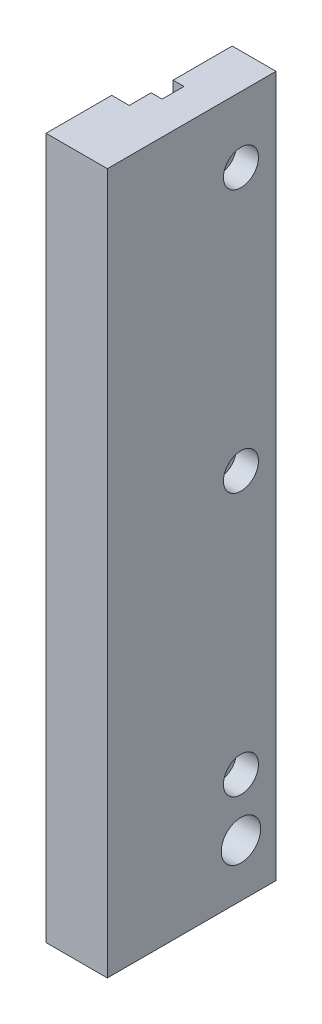
ISO-10303-21;
HEADER;
FILE_DESCRIPTION(('STEP AP214'),'2;1');
FILE_NAME('part.step','',(''),(''),'','','');
FILE_SCHEMA(('AUTOMOTIVE_DESIGN { 1 0 10303 214 1 1 1 1 }'));
ENDSEC;
DATA;
#1=APPLICATION_CONTEXT('core data for automotive mechanical design processes');
#2=APPLICATION_PROTOCOL_DEFINITION('international standard','automotive_design',2000,#1);
#3=PRODUCT_CONTEXT('',#1,'mechanical');
#4=PRODUCT('Part','Part','',(#3));
#5=PRODUCT_RELATED_PRODUCT_CATEGORY('part','',(#4));
#6=PRODUCT_DEFINITION_FORMATION('','',#4);
#7=PRODUCT_DEFINITION_CONTEXT('part definition',#1,'design');
#8=PRODUCT_DEFINITION('design','',#6,#7);
#9=PRODUCT_DEFINITION_SHAPE('','',#8);
#10=(LENGTH_UNIT() NAMED_UNIT(*) SI_UNIT(.MILLI.,.METRE.));
#11=(NAMED_UNIT(*) PLANE_ANGLE_UNIT() SI_UNIT($,.RADIAN.));
#12=(NAMED_UNIT(*) SI_UNIT($,.STERADIAN.) SOLID_ANGLE_UNIT());
#13=UNCERTAINTY_MEASURE_WITH_UNIT(LENGTH_MEASURE(1.E-05),#10,'distance_accuracy_value','');
#14=(GEOMETRIC_REPRESENTATION_CONTEXT(3) GLOBAL_UNCERTAINTY_ASSIGNED_CONTEXT((#13)) GLOBAL_UNIT_ASSIGNED_CONTEXT((#10,
#11,#12)) REPRESENTATION_CONTEXT('',''));
#15=CARTESIAN_POINT('',(0.,0.,0.));
#16=DIRECTION('',(0.,0.,1.));
#17=DIRECTION('',(1.,0.,0.));
#18=AXIS2_PLACEMENT_3D('',#15,#16,#17);
#19=CARTESIAN_POINT('',(10.,160.,0.));
#20=DIRECTION('',(0.,0.,-1.));
#21=DIRECTION('',(-1.,0.,0.));
#22=AXIS2_PLACEMENT_3D('',#19,#20,#21);
#23=PLANE('',#22);
#24=DIRECTION('',(1.,0.,0.));
#25=VECTOR('',#24,1.);
#26=CARTESIAN_POINT('',(10.,0.,0.));
#27=LINE('',#26,#25);
#28=CARTESIAN_POINT('',(-4.,0.,0.));
#29=VERTEX_POINT('',#28);
#30=CARTESIAN_POINT('',(10.,0.,0.));
#31=VERTEX_POINT('',#30);
#32=EDGE_CURVE('E99',#29,#31,#27,.T.);
#33=ORIENTED_EDGE('',*,*,#32,.T.);
#34=DIRECTION('',(0.,-1.,0.));
#35=VECTOR('',#34,1.);
#36=CARTESIAN_POINT('',(10.,160.,0.));
#37=LINE('',#36,#35);
#38=CARTESIAN_POINT('',(10.,160.,0.));
#39=VERTEX_POINT('',#38);
#40=EDGE_CURVE('E11',#39,#31,#37,.T.);
#41=ORIENTED_EDGE('',*,*,#40,.F.);
#42=DIRECTION('',(1.,0.,0.));
#43=VECTOR('',#42,1.);
#44=CARTESIAN_POINT('',(-4.,160.,0.));
#45=LINE('',#44,#43);
#46=CARTESIAN_POINT('',(-4.,160.,0.));
#47=VERTEX_POINT('',#46);
#48=EDGE_CURVE('E105',#47,#39,#45,.T.);
#49=ORIENTED_EDGE('',*,*,#48,.F.);
#50=DIRECTION('',(0.,-1.,0.));
#51=VECTOR('',#50,1.);
#52=CARTESIAN_POINT('',(-4.,160.,0.));
#53=LINE('',#52,#51);
#54=EDGE_CURVE('E145',#47,#29,#53,.T.);
#55=ORIENTED_EDGE('',*,*,#54,.T.);
#56=EDGE_LOOP('',(#33,#41,#49,#55));
#57=FACE_BOUND('',#56,.T.);
#58=ADVANCED_FACE('F39',(#57),#23,.F.);
#59=CARTESIAN_POINT('',(10.,160.,-38.5));
#60=DIRECTION('',(-1.,0.,0.));
#61=DIRECTION('',(0.,0.,1.));
#62=AXIS2_PLACEMENT_3D('',#59,#60,#61);
#63=PLANE('',#62);
#64=CARTESIAN_POINT('',(10.,145.,-30.5));
#65=DIRECTION('',(1.,0.,0.));
#66=DIRECTION('',(0.,0.,-1.));
#67=AXIS2_PLACEMENT_3D('',#64,#65,#66);
#68=CIRCLE('',#67,4.00000000000001);
#69=CARTESIAN_POINT('',(10.,145.,-34.5));
#70=VERTEX_POINT('',#69);
#71=EDGE_CURVE('E270',#70,#70,#68,.T.);
#72=ORIENTED_EDGE('',*,*,#71,.F.);
#73=EDGE_LOOP('',(#72));
#74=FACE_BOUND('',#73,.T.);
#75=CARTESIAN_POINT('',(10.,85.,-30.5));
#76=DIRECTION('',(1.,0.,0.));
#77=DIRECTION('',(0.,0.,-1.));
#78=AXIS2_PLACEMENT_3D('',#75,#76,#77);
#79=CIRCLE('',#78,4.00000000000001);
#80=CARTESIAN_POINT('',(10.,85.,-34.5));
#81=VERTEX_POINT('',#80);
#82=EDGE_CURVE('E274',#81,#81,#79,.T.);
#83=ORIENTED_EDGE('',*,*,#82,.F.);
#84=EDGE_LOOP('',(#83));
#85=FACE_BOUND('',#84,.T.);
#86=CARTESIAN_POINT('',(10.,25.,-30.5));
#87=DIRECTION('',(1.,0.,0.));
#88=DIRECTION('',(0.,0.,-1.));
#89=AXIS2_PLACEMENT_3D('',#86,#87,#88);
#90=CIRCLE('',#89,4.00000000000001);
#91=CARTESIAN_POINT('',(10.,25.,-34.5));
#92=VERTEX_POINT('',#91);
#93=EDGE_CURVE('E205',#92,#92,#90,.T.);
#94=ORIENTED_EDGE('',*,*,#93,.F.);
#95=EDGE_LOOP('',(#94));
#96=FACE_BOUND('',#95,.T.);
#97=CARTESIAN_POINT('',(10.,12.,-30.5));
#98=DIRECTION('',(1.,0.,0.));
#99=DIRECTION('',(0.,0.,-1.));
#100=AXIS2_PLACEMENT_3D('',#97,#98,#99);
#101=CIRCLE('',#100,4.5);
#102=CARTESIAN_POINT('',(10.,12.,-35.));
#103=VERTEX_POINT('',#102);
#104=EDGE_CURVE('E196',#103,#103,#101,.T.);
#105=ORIENTED_EDGE('',*,*,#104,.F.);
#106=EDGE_LOOP('',(#105));
#107=FACE_BOUND('',#106,.T.);
#108=DIRECTION('',(0.,0.,-1.));
#109=VECTOR('',#108,1.);
#110=CARTESIAN_POINT('',(10.,0.,-38.5));
#111=LINE('',#110,#109);
#112=CARTESIAN_POINT('',(10.,0.,-38.5));
#113=VERTEX_POINT('',#112);
#114=EDGE_CURVE('E150',#31,#113,#111,.T.);
#115=ORIENTED_EDGE('',*,*,#114,.T.);
#116=DIRECTION('',(0.,-1.,0.));
#117=VECTOR('',#116,1.);
#118=CARTESIAN_POINT('',(10.,160.,-38.5));
#119=LINE('',#118,#117);
#120=CARTESIAN_POINT('',(10.,160.,-38.5));
#121=VERTEX_POINT('',#120);
#122=EDGE_CURVE('E48',#121,#113,#119,.T.);
#123=ORIENTED_EDGE('',*,*,#122,.F.);
#124=DIRECTION('',(0.,0.,-1.));
#125=VECTOR('',#124,1.);
#126=CARTESIAN_POINT('',(10.,160.,-38.5));
#127=LINE('',#126,#125);
#128=EDGE_CURVE('E210',#39,#121,#127,.T.);
#129=ORIENTED_EDGE('',*,*,#128,.F.);
#130=ORIENTED_EDGE('',*,*,#40,.T.);
#131=EDGE_LOOP('',(#115,#123,#129,#130));
#132=FACE_BOUND('',#131,.T.);
#133=ADVANCED_FACE('F236',(#74,#85,#96,#107,#132),#63,.F.);
#134=CARTESIAN_POINT('',(0.,160.,-38.5));
#135=DIRECTION('',(0.,0.,1.));
#136=DIRECTION('',(1.,0.,0.));
#137=AXIS2_PLACEMENT_3D('',#134,#135,#136);
#138=PLANE('',#137);
#139=DIRECTION('',(-1.,0.,0.));
#140=VECTOR('',#139,1.);
#141=CARTESIAN_POINT('',(0.,0.,-38.5));
#142=LINE('',#141,#140);
#143=CARTESIAN_POINT('',(0.,0.,-38.5));
#144=VERTEX_POINT('',#143);
#145=EDGE_CURVE('E153',#113,#144,#142,.T.);
#146=ORIENTED_EDGE('',*,*,#145,.T.);
#147=DIRECTION('',(0.,-1.,0.));
#148=VECTOR('',#147,1.);
#149=CARTESIAN_POINT('',(0.,160.,-38.5));
#150=LINE('',#149,#148);
#151=CARTESIAN_POINT('',(0.,160.,-38.5));
#152=VERTEX_POINT('',#151);
#153=EDGE_CURVE('E180',#152,#144,#150,.T.);
#154=ORIENTED_EDGE('',*,*,#153,.F.);
#155=DIRECTION('',(-1.,0.,0.));
#156=VECTOR('',#155,1.);
#157=CARTESIAN_POINT('',(0.,160.,-38.5));
#158=LINE('',#157,#156);
#159=EDGE_CURVE('E212',#121,#152,#158,.T.);
#160=ORIENTED_EDGE('',*,*,#159,.F.);
#161=ORIENTED_EDGE('',*,*,#122,.T.);
#162=EDGE_LOOP('',(#146,#154,#160,#161));
#163=FACE_BOUND('',#162,.T.);
#164=ADVANCED_FACE('F242',(#163),#138,.F.);
#165=CARTESIAN_POINT('',(0.,160.,-25.));
#166=DIRECTION('',(1.,0.,0.));
#167=DIRECTION('',(0.,0.,-1.));
#168=AXIS2_PLACEMENT_3D('',#165,#166,#167);
#169=PLANE('',#168);
#170=CARTESIAN_POINT('',(0.,145.,-30.5));
#171=DIRECTION('',(1.,0.,0.));
#172=DIRECTION('',(0.,0.,-1.));
#173=AXIS2_PLACEMENT_3D('',#170,#171,#172);
#174=CIRCLE('',#173,2.5);
#175=CARTESIAN_POINT('',(0.,145.,-33.));
#176=VERTEX_POINT('',#175);
#177=EDGE_CURVE('E42',#176,#176,#174,.T.);
#178=ORIENTED_EDGE('',*,*,#177,.T.);
#179=EDGE_LOOP('',(#178));
#180=FACE_BOUND('',#179,.T.);
#181=CARTESIAN_POINT('',(0.,85.,-30.5));
#182=DIRECTION('',(1.,0.,0.));
#183=DIRECTION('',(0.,0.,-1.));
#184=AXIS2_PLACEMENT_3D('',#181,#182,#183);
#185=CIRCLE('',#184,2.5);
#186=CARTESIAN_POINT('',(0.,85.,-33.));
#187=VERTEX_POINT('',#186);
#188=EDGE_CURVE('E191',#187,#187,#185,.T.);
#189=ORIENTED_EDGE('',*,*,#188,.T.);
#190=EDGE_LOOP('',(#189));
#191=FACE_BOUND('',#190,.T.);
#192=CARTESIAN_POINT('',(0.,25.,-30.5));
#193=DIRECTION('',(1.,0.,0.));
#194=DIRECTION('',(0.,0.,-1.));
#195=AXIS2_PLACEMENT_3D('',#192,#193,#194);
#196=CIRCLE('',#195,2.5);
#197=CARTESIAN_POINT('',(0.,25.,-33.));
#198=VERTEX_POINT('',#197);
#199=EDGE_CURVE('E188',#198,#198,#196,.T.);
#200=ORIENTED_EDGE('',*,*,#199,.T.);
#201=EDGE_LOOP('',(#200));
#202=FACE_BOUND('',#201,.T.);
#203=CARTESIAN_POINT('',(0.,12.,-30.5));
#204=DIRECTION('',(1.,0.,0.));
#205=DIRECTION('',(0.,0.,-1.));
#206=AXIS2_PLACEMENT_3D('',#203,#204,#205);
#207=CIRCLE('',#206,4.5);
#208=CARTESIAN_POINT('',(0.,12.,-35.));
#209=VERTEX_POINT('',#208);
#210=EDGE_CURVE('E185',#209,#209,#207,.T.);
#211=ORIENTED_EDGE('',*,*,#210,.T.);
#212=EDGE_LOOP('',(#211));
#213=FACE_BOUND('',#212,.T.);
#214=DIRECTION('',(0.,0.,1.));
#215=VECTOR('',#214,1.);
#216=CARTESIAN_POINT('',(0.,0.,-25.));
#217=LINE('',#216,#215);
#218=CARTESIAN_POINT('',(0.,0.,-25.));
#219=VERTEX_POINT('',#218);
#220=EDGE_CURVE('E155',#144,#219,#217,.T.);
#221=ORIENTED_EDGE('',*,*,#220,.T.);
#222=DIRECTION('',(0.,-1.,0.));
#223=VECTOR('',#222,1.);
#224=CARTESIAN_POINT('',(0.,160.,-25.));
#225=LINE('',#224,#223);
#226=CARTESIAN_POINT('',(0.,160.,-25.));
#227=VERTEX_POINT('',#226);
#228=EDGE_CURVE('E177',#227,#219,#225,.T.);
#229=ORIENTED_EDGE('',*,*,#228,.F.);
#230=DIRECTION('',(0.,0.,1.));
#231=VECTOR('',#230,1.);
#232=CARTESIAN_POINT('',(0.,160.,-25.));
#233=LINE('',#232,#231);
#234=EDGE_CURVE('E214',#152,#227,#233,.T.);
#235=ORIENTED_EDGE('',*,*,#234,.F.);
#236=ORIENTED_EDGE('',*,*,#153,.T.);
#237=EDGE_LOOP('',(#221,#229,#235,#236));
#238=FACE_BOUND('',#237,.T.);
#239=ADVANCED_FACE('F246',(#180,#191,#202,#213,#238),#169,.F.);
#240=CARTESIAN_POINT('',(2.5,160.,-25.));
#241=DIRECTION('',(0.,0.,-1.));
#242=DIRECTION('',(-1.,0.,0.));
#243=AXIS2_PLACEMENT_3D('',#240,#241,#242);
#244=PLANE('',#243);
#245=DIRECTION('',(1.,0.,0.));
#246=VECTOR('',#245,1.);
#247=CARTESIAN_POINT('',(2.5,0.,-25.));
#248=LINE('',#247,#246);
#249=CARTESIAN_POINT('',(2.5,0.,-25.));
#250=VERTEX_POINT('',#249);
#251=EDGE_CURVE('E157',#219,#250,#248,.T.);
#252=ORIENTED_EDGE('',*,*,#251,.T.);
#253=DIRECTION('',(0.,-1.,0.));
#254=VECTOR('',#253,1.);
#255=CARTESIAN_POINT('',(2.5,160.,-25.));
#256=LINE('',#255,#254);
#257=CARTESIAN_POINT('',(2.5,160.,-25.));
#258=VERTEX_POINT('',#257);
#259=EDGE_CURVE('E174',#258,#250,#256,.T.);
#260=ORIENTED_EDGE('',*,*,#259,.F.);
#261=DIRECTION('',(1.,0.,0.));
#262=VECTOR('',#261,1.);
#263=CARTESIAN_POINT('',(2.5,160.,-25.));
#264=LINE('',#263,#262);
#265=EDGE_CURVE('E216',#227,#258,#264,.T.);
#266=ORIENTED_EDGE('',*,*,#265,.F.);
#267=ORIENTED_EDGE('',*,*,#228,.T.);
#268=EDGE_LOOP('',(#252,#260,#266,#267));
#269=FACE_BOUND('',#268,.T.);
#270=ADVANCED_FACE('F249',(#269),#244,.F.);
#271=CARTESIAN_POINT('',(2.5,160.,-20.));
#272=DIRECTION('',(1.,0.,0.));
#273=DIRECTION('',(0.,0.,-1.));
#274=AXIS2_PLACEMENT_3D('',#271,#272,#273);
#275=PLANE('',#274);
#276=DIRECTION('',(0.,0.,1.));
#277=VECTOR('',#276,1.);
#278=CARTESIAN_POINT('',(2.5,0.,-20.));
#279=LINE('',#278,#277);
#280=CARTESIAN_POINT('',(2.5,0.,-20.));
#281=VERTEX_POINT('',#280);
#282=EDGE_CURVE('E159',#250,#281,#279,.T.);
#283=ORIENTED_EDGE('',*,*,#282,.T.);
#284=DIRECTION('',(0.,-1.,0.));
#285=VECTOR('',#284,1.);
#286=CARTESIAN_POINT('',(2.5,160.,-20.));
#287=LINE('',#286,#285);
#288=CARTESIAN_POINT('',(2.5,160.,-20.));
#289=VERTEX_POINT('',#288);
#290=EDGE_CURVE('E171',#289,#281,#287,.T.);
#291=ORIENTED_EDGE('',*,*,#290,.F.);
#292=DIRECTION('',(0.,0.,1.));
#293=VECTOR('',#292,1.);
#294=CARTESIAN_POINT('',(2.5,160.,-20.));
#295=LINE('',#294,#293);
#296=EDGE_CURVE('E218',#258,#289,#295,.T.);
#297=ORIENTED_EDGE('',*,*,#296,.F.);
#298=ORIENTED_EDGE('',*,*,#259,.T.);
#299=EDGE_LOOP('',(#283,#291,#297,#298));
#300=FACE_BOUND('',#299,.T.);
#301=ADVANCED_FACE('F224',(#300),#275,.F.);
#302=CARTESIAN_POINT('',(0.,160.,-20.));
#303=DIRECTION('',(0.,0.,1.));
#304=DIRECTION('',(1.,0.,0.));
#305=AXIS2_PLACEMENT_3D('',#302,#303,#304);
#306=PLANE('',#305);
#307=DIRECTION('',(-1.,0.,0.));
#308=VECTOR('',#307,1.);
#309=CARTESIAN_POINT('',(0.,0.,-20.));
#310=LINE('',#309,#308);
#311=CARTESIAN_POINT('',(0.,0.,-20.));
#312=VERTEX_POINT('',#311);
#313=EDGE_CURVE('E161',#281,#312,#310,.T.);
#314=ORIENTED_EDGE('',*,*,#313,.T.);
#315=DIRECTION('',(0.,-1.,0.));
#316=VECTOR('',#315,1.);
#317=CARTESIAN_POINT('',(0.,160.,-20.));
#318=LINE('',#317,#316);
#319=CARTESIAN_POINT('',(0.,160.,-20.));
#320=VERTEX_POINT('',#319);
#321=EDGE_CURVE('E140',#320,#312,#318,.T.);
#322=ORIENTED_EDGE('',*,*,#321,.F.);
#323=DIRECTION('',(-1.,0.,0.));
#324=VECTOR('',#323,1.);
#325=CARTESIAN_POINT('',(0.,160.,-20.));
#326=LINE('',#325,#324);
#327=EDGE_CURVE('E131',#289,#320,#326,.T.);
#328=ORIENTED_EDGE('',*,*,#327,.F.);
#329=ORIENTED_EDGE('',*,*,#290,.T.);
#330=EDGE_LOOP('',(#314,#322,#328,#329));
#331=FACE_BOUND('',#330,.T.);
#332=ADVANCED_FACE('F228',(#331),#306,.F.);
#333=CARTESIAN_POINT('',(0.,160.,-20.));
#334=DIRECTION('',(1.,0.,0.));
#335=DIRECTION('',(0.,0.,-1.));
#336=AXIS2_PLACEMENT_3D('',#333,#334,#335);
#337=PLANE('',#336);
#338=DIRECTION('',(0.,0.,1.));
#339=VECTOR('',#338,1.);
#340=CARTESIAN_POINT('',(0.,0.,-20.));
#341=LINE('',#340,#339);
#342=CARTESIAN_POINT('',(0.,0.,-15.));
#343=VERTEX_POINT('',#342);
#344=EDGE_CURVE('E139',#312,#343,#341,.T.);
#345=ORIENTED_EDGE('',*,*,#344,.T.);
#346=DIRECTION('',(0.,-1.,0.));
#347=VECTOR('',#346,1.);
#348=CARTESIAN_POINT('',(0.,160.,-15.));
#349=LINE('',#348,#347);
#350=CARTESIAN_POINT('',(0.,160.,-15.));
#351=VERTEX_POINT('',#350);
#352=EDGE_CURVE('E136',#351,#343,#349,.T.);
#353=ORIENTED_EDGE('',*,*,#352,.F.);
#354=DIRECTION('',(0.,0.,1.));
#355=VECTOR('',#354,1.);
#356=CARTESIAN_POINT('',(0.,160.,-20.));
#357=LINE('',#356,#355);
#358=EDGE_CURVE('E125',#320,#351,#357,.T.);
#359=ORIENTED_EDGE('',*,*,#358,.F.);
#360=ORIENTED_EDGE('',*,*,#321,.T.);
#361=EDGE_LOOP('',(#345,#353,#359,#360));
#362=FACE_BOUND('',#361,.T.);
#363=ADVANCED_FACE('F137',(#362),#337,.F.);
#364=CARTESIAN_POINT('',(0.,160.,-15.));
#365=DIRECTION('',(0.,0.,1.));
#366=DIRECTION('',(1.,0.,0.));
#367=AXIS2_PLACEMENT_3D('',#364,#365,#366);
#368=PLANE('',#367);
#369=DIRECTION('',(-1.,0.,0.));
#370=VECTOR('',#369,1.);
#371=CARTESIAN_POINT('',(0.,0.,-15.));
#372=LINE('',#371,#370);
#373=CARTESIAN_POINT('',(-4.,0.,-15.));
#374=VERTEX_POINT('',#373);
#375=EDGE_CURVE('E92',#343,#374,#372,.T.);
#376=ORIENTED_EDGE('',*,*,#375,.T.);
#377=DIRECTION('',(0.,-1.,0.));
#378=VECTOR('',#377,1.);
#379=CARTESIAN_POINT('',(-4.,160.,-15.));
#380=LINE('',#379,#378);
#381=CARTESIAN_POINT('',(-4.,160.,-15.));
#382=VERTEX_POINT('',#381);
#383=EDGE_CURVE('E141',#382,#374,#380,.T.);
#384=ORIENTED_EDGE('',*,*,#383,.F.);
#385=DIRECTION('',(-1.,0.,0.));
#386=VECTOR('',#385,1.);
#387=CARTESIAN_POINT('',(0.,160.,-15.));
#388=LINE('',#387,#386);
#389=EDGE_CURVE('E129',#351,#382,#388,.T.);
#390=ORIENTED_EDGE('',*,*,#389,.F.);
#391=ORIENTED_EDGE('',*,*,#352,.T.);
#392=EDGE_LOOP('',(#376,#384,#390,#391));
#393=FACE_BOUND('',#392,.T.);
#394=ADVANCED_FACE('F143',(#393),#368,.F.);
#395=CARTESIAN_POINT('',(-4.,160.,-15.));
#396=DIRECTION('',(1.,0.,0.));
#397=DIRECTION('',(0.,0.,-1.));
#398=AXIS2_PLACEMENT_3D('',#395,#396,#397);
#399=PLANE('',#398);
#400=DIRECTION('',(0.,0.,1.));
#401=VECTOR('',#400,1.);
#402=CARTESIAN_POINT('',(-4.,0.,-15.));
#403=LINE('',#402,#401);
#404=EDGE_CURVE('E165',#374,#29,#403,.T.);
#405=ORIENTED_EDGE('',*,*,#404,.T.);
#406=ORIENTED_EDGE('',*,*,#54,.F.);
#407=DIRECTION('',(0.,0.,1.));
#408=VECTOR('',#407,1.);
#409=CARTESIAN_POINT('',(-4.,160.,-15.));
#410=LINE('',#409,#408);
#411=EDGE_CURVE('E57',#382,#47,#410,.T.);
#412=ORIENTED_EDGE('',*,*,#411,.F.);
#413=ORIENTED_EDGE('',*,*,#383,.T.);
#414=EDGE_LOOP('',(#405,#406,#412,#413));
#415=FACE_BOUND('',#414,.T.);
#416=ADVANCED_FACE('F231',(#415),#399,.F.);
#417=CARTESIAN_POINT('',(0.,160.,0.));
#418=DIRECTION('',(0.,-1.,0.));
#419=DIRECTION('',(0.,0.,-1.));
#420=AXIS2_PLACEMENT_3D('',#417,#418,#419);
#421=PLANE('',#420);
#422=ORIENTED_EDGE('',*,*,#48,.T.);
#423=ORIENTED_EDGE('',*,*,#128,.T.);
#424=ORIENTED_EDGE('',*,*,#159,.T.);
#425=ORIENTED_EDGE('',*,*,#234,.T.);
#426=ORIENTED_EDGE('',*,*,#265,.T.);
#427=ORIENTED_EDGE('',*,*,#296,.T.);
#428=ORIENTED_EDGE('',*,*,#327,.T.);
#429=ORIENTED_EDGE('',*,*,#358,.T.);
#430=ORIENTED_EDGE('',*,*,#389,.T.);
#431=ORIENTED_EDGE('',*,*,#411,.T.);
#432=EDGE_LOOP('',(#422,#423,#424,#425,#426,#427,#428,#429,#430,#431));
#433=FACE_BOUND('',#432,.T.);
#434=ADVANCED_FACE('F127',(#433),#421,.F.);
#435=CARTESIAN_POINT('',(0.,0.,0.));
#436=DIRECTION('',(0.,-1.,0.));
#437=DIRECTION('',(0.,0.,-1.));
#438=AXIS2_PLACEMENT_3D('',#435,#436,#437);
#439=PLANE('',#438);
#440=ORIENTED_EDGE('',*,*,#32,.F.);
#441=ORIENTED_EDGE('',*,*,#404,.F.);
#442=ORIENTED_EDGE('',*,*,#375,.F.);
#443=ORIENTED_EDGE('',*,*,#344,.F.);
#444=ORIENTED_EDGE('',*,*,#313,.F.);
#445=ORIENTED_EDGE('',*,*,#282,.F.);
#446=ORIENTED_EDGE('',*,*,#251,.F.);
#447=ORIENTED_EDGE('',*,*,#220,.F.);
#448=ORIENTED_EDGE('',*,*,#145,.F.);
#449=ORIENTED_EDGE('',*,*,#114,.F.);
#450=EDGE_LOOP('',(#440,#441,#442,#443,#444,#445,#446,#447,#448,#449));
#451=FACE_BOUND('',#450,.T.);
#452=ADVANCED_FACE('F229',(#451),#439,.T.);
#453=CARTESIAN_POINT('',(5.,12.,-30.5));
#454=DIRECTION('',(1.,0.,0.));
#455=DIRECTION('',(0.,0.,-1.));
#456=AXIS2_PLACEMENT_3D('',#453,#454,#455);
#457=CYLINDRICAL_SURFACE('',#456,4.5);
#458=ORIENTED_EDGE('',*,*,#104,.T.);
#459=EDGE_LOOP('',(#458));
#460=FACE_BOUND('',#459,.T.);
#461=ORIENTED_EDGE('',*,*,#210,.F.);
#462=EDGE_LOOP('',(#461));
#463=FACE_BOUND('',#462,.T.);
#464=ADVANCED_FACE('F326',(#460,#463),#457,.F.);
#465=CARTESIAN_POINT('',(5.,25.,-30.5));
#466=DIRECTION('',(1.,0.,0.));
#467=DIRECTION('',(0.,0.,-1.));
#468=AXIS2_PLACEMENT_3D('',#465,#466,#467);
#469=CYLINDRICAL_SURFACE('',#468,4.00000000000001);
#470=CARTESIAN_POINT('',(5.,25.,-30.5));
#471=DIRECTION('',(1.,0.,0.));
#472=DIRECTION('',(0.,0.,-1.));
#473=AXIS2_PLACEMENT_3D('',#470,#471,#472);
#474=CIRCLE('',#473,4.00000000000001);
#475=CARTESIAN_POINT('',(5.,25.,-34.5));
#476=VERTEX_POINT('',#475);
#477=EDGE_CURVE('E200',#476,#476,#474,.T.);
#478=ORIENTED_EDGE('',*,*,#477,.F.);
#479=EDGE_LOOP('',(#478));
#480=FACE_BOUND('',#479,.T.);
#481=ORIENTED_EDGE('',*,*,#93,.T.);
#482=EDGE_LOOP('',(#481));
#483=FACE_BOUND('',#482,.T.);
#484=ADVANCED_FACE('F323',(#480,#483),#469,.F.);
#485=CARTESIAN_POINT('',(5.,25.,-30.5));
#486=DIRECTION('',(1.,0.,0.));
#487=DIRECTION('',(0.,0.,-1.));
#488=AXIS2_PLACEMENT_3D('',#485,#486,#487);
#489=PLANE('',#488);
#490=CARTESIAN_POINT('',(5.,25.,-30.5));
#491=DIRECTION('',(1.,0.,0.));
#492=DIRECTION('',(0.,0.,-1.));
#493=AXIS2_PLACEMENT_3D('',#490,#491,#492);
#494=CIRCLE('',#493,2.5);
#495=CARTESIAN_POINT('',(5.,25.,-33.));
#496=VERTEX_POINT('',#495);
#497=EDGE_CURVE('E287',#496,#496,#494,.T.);
#498=ORIENTED_EDGE('',*,*,#497,.F.);
#499=EDGE_LOOP('',(#498));
#500=FACE_BOUND('',#499,.T.);
#501=ORIENTED_EDGE('',*,*,#477,.T.);
#502=EDGE_LOOP('',(#501));
#503=FACE_BOUND('',#502,.T.);
#504=ADVANCED_FACE('F320',(#500,#503),#489,.T.);
#505=CARTESIAN_POINT('',(5.,85.,-30.5));
#506=DIRECTION('',(1.,0.,0.));
#507=DIRECTION('',(0.,0.,-1.));
#508=AXIS2_PLACEMENT_3D('',#505,#506,#507);
#509=CYLINDRICAL_SURFACE('',#508,4.00000000000001);
#510=CARTESIAN_POINT('',(5.,85.,-30.5));
#511=DIRECTION('',(1.,0.,0.));
#512=DIRECTION('',(0.,0.,-1.));
#513=AXIS2_PLACEMENT_3D('',#510,#511,#512);
#514=CIRCLE('',#513,4.00000000000001);
#515=CARTESIAN_POINT('',(5.,85.,-34.5));
#516=VERTEX_POINT('',#515);
#517=EDGE_CURVE('E279',#516,#516,#514,.T.);
#518=ORIENTED_EDGE('',*,*,#517,.F.);
#519=EDGE_LOOP('',(#518));
#520=FACE_BOUND('',#519,.T.);
#521=ORIENTED_EDGE('',*,*,#82,.T.);
#522=EDGE_LOOP('',(#521));
#523=FACE_BOUND('',#522,.T.);
#524=ADVANCED_FACE('F314',(#520,#523),#509,.F.);
#525=CARTESIAN_POINT('',(5.,85.,-30.5));
#526=DIRECTION('',(1.,0.,0.));
#527=DIRECTION('',(0.,0.,-1.));
#528=AXIS2_PLACEMENT_3D('',#525,#526,#527);
#529=PLANE('',#528);
#530=CARTESIAN_POINT('',(5.,85.,-30.5));
#531=DIRECTION('',(1.,0.,0.));
#532=DIRECTION('',(0.,0.,-1.));
#533=AXIS2_PLACEMENT_3D('',#530,#531,#532);
#534=CIRCLE('',#533,2.5);
#535=CARTESIAN_POINT('',(5.,85.,-33.));
#536=VERTEX_POINT('',#535);
#537=EDGE_CURVE('E290',#536,#536,#534,.T.);
#538=ORIENTED_EDGE('',*,*,#537,.F.);
#539=EDGE_LOOP('',(#538));
#540=FACE_BOUND('',#539,.T.);
#541=ORIENTED_EDGE('',*,*,#517,.T.);
#542=EDGE_LOOP('',(#541));
#543=FACE_BOUND('',#542,.T.);
#544=ADVANCED_FACE('F309',(#540,#543),#529,.T.);
#545=CARTESIAN_POINT('',(5.,145.,-30.5));
#546=DIRECTION('',(1.,0.,0.));
#547=DIRECTION('',(0.,0.,-1.));
#548=AXIS2_PLACEMENT_3D('',#545,#546,#547);
#549=CYLINDRICAL_SURFACE('',#548,4.00000000000001);
#550=CARTESIAN_POINT('',(5.,145.,-30.5));
#551=DIRECTION('',(1.,0.,0.));
#552=DIRECTION('',(0.,0.,-1.));
#553=AXIS2_PLACEMENT_3D('',#550,#551,#552);
#554=CIRCLE('',#553,4.00000000000001);
#555=CARTESIAN_POINT('',(5.,145.,-34.5));
#556=VERTEX_POINT('',#555);
#557=EDGE_CURVE('E151',#556,#556,#554,.T.);
#558=ORIENTED_EDGE('',*,*,#557,.F.);
#559=EDGE_LOOP('',(#558));
#560=FACE_BOUND('',#559,.T.);
#561=ORIENTED_EDGE('',*,*,#71,.T.);
#562=EDGE_LOOP('',(#561));
#563=FACE_BOUND('',#562,.T.);
#564=ADVANCED_FACE('F303',(#560,#563),#549,.F.);
#565=CARTESIAN_POINT('',(5.,145.,-30.5));
#566=DIRECTION('',(1.,0.,0.));
#567=DIRECTION('',(0.,0.,-1.));
#568=AXIS2_PLACEMENT_3D('',#565,#566,#567);
#569=PLANE('',#568);
#570=CARTESIAN_POINT('',(5.,145.,-30.5));
#571=DIRECTION('',(1.,0.,0.));
#572=DIRECTION('',(0.,0.,-1.));
#573=AXIS2_PLACEMENT_3D('',#570,#571,#572);
#574=CIRCLE('',#573,2.5);
#575=CARTESIAN_POINT('',(5.,145.,-33.));
#576=VERTEX_POINT('',#575);
#577=EDGE_CURVE('E189',#576,#576,#574,.T.);
#578=ORIENTED_EDGE('',*,*,#577,.F.);
#579=EDGE_LOOP('',(#578));
#580=FACE_BOUND('',#579,.T.);
#581=ORIENTED_EDGE('',*,*,#557,.T.);
#582=EDGE_LOOP('',(#581));
#583=FACE_BOUND('',#582,.T.);
#584=ADVANCED_FACE('F299',(#580,#583),#569,.T.);
#585=CARTESIAN_POINT('',(-4.00000000000001,25.,-30.5));
#586=DIRECTION('',(1.,0.,0.));
#587=DIRECTION('',(0.,0.,-1.));
#588=AXIS2_PLACEMENT_3D('',#585,#586,#587);
#589=CYLINDRICAL_SURFACE('',#588,2.5);
#590=ORIENTED_EDGE('',*,*,#497,.T.);
#591=EDGE_LOOP('',(#590));
#592=FACE_BOUND('',#591,.T.);
#593=ORIENTED_EDGE('',*,*,#199,.F.);
#594=EDGE_LOOP('',(#593));
#595=FACE_BOUND('',#594,.T.);
#596=ADVANCED_FACE('F302',(#592,#595),#589,.F.);
#597=CARTESIAN_POINT('',(-4.00000000000001,85.,-30.5));
#598=DIRECTION('',(1.,0.,0.));
#599=DIRECTION('',(0.,0.,-1.));
#600=AXIS2_PLACEMENT_3D('',#597,#598,#599);
#601=CYLINDRICAL_SURFACE('',#600,2.5);
#602=ORIENTED_EDGE('',*,*,#537,.T.);
#603=EDGE_LOOP('',(#602));
#604=FACE_BOUND('',#603,.T.);
#605=ORIENTED_EDGE('',*,*,#188,.F.);
#606=EDGE_LOOP('',(#605));
#607=FACE_BOUND('',#606,.T.);
#608=ADVANCED_FACE('F407',(#604,#607),#601,.F.);
#609=CARTESIAN_POINT('',(-4.00000000000001,145.,-30.5));
#610=DIRECTION('',(1.,0.,0.));
#611=DIRECTION('',(0.,0.,-1.));
#612=AXIS2_PLACEMENT_3D('',#609,#610,#611);
#613=CYLINDRICAL_SURFACE('',#612,2.5);
#614=ORIENTED_EDGE('',*,*,#577,.T.);
#615=EDGE_LOOP('',(#614));
#616=FACE_BOUND('',#615,.T.);
#617=ORIENTED_EDGE('',*,*,#177,.F.);
#618=EDGE_LOOP('',(#617));
#619=FACE_BOUND('',#618,.T.);
#620=ADVANCED_FACE('F296',(#616,#619),#613,.F.);
#621=CLOSED_SHELL('',(#58,#133,#164,#239,#270,#301,#332,#363,#394,#416,#434,#452,#464,#484,#504,
#524,#544,#564,#584,#596,#608,#620));
#622=MANIFOLD_SOLID_BREP('B2',#621);
#623=ADVANCED_BREP_SHAPE_REPRESENTATION('',(#18,#622),#14);
#624=SHAPE_DEFINITION_REPRESENTATION(#9,#623);
ENDSEC;
END-ISO-10303-21;
